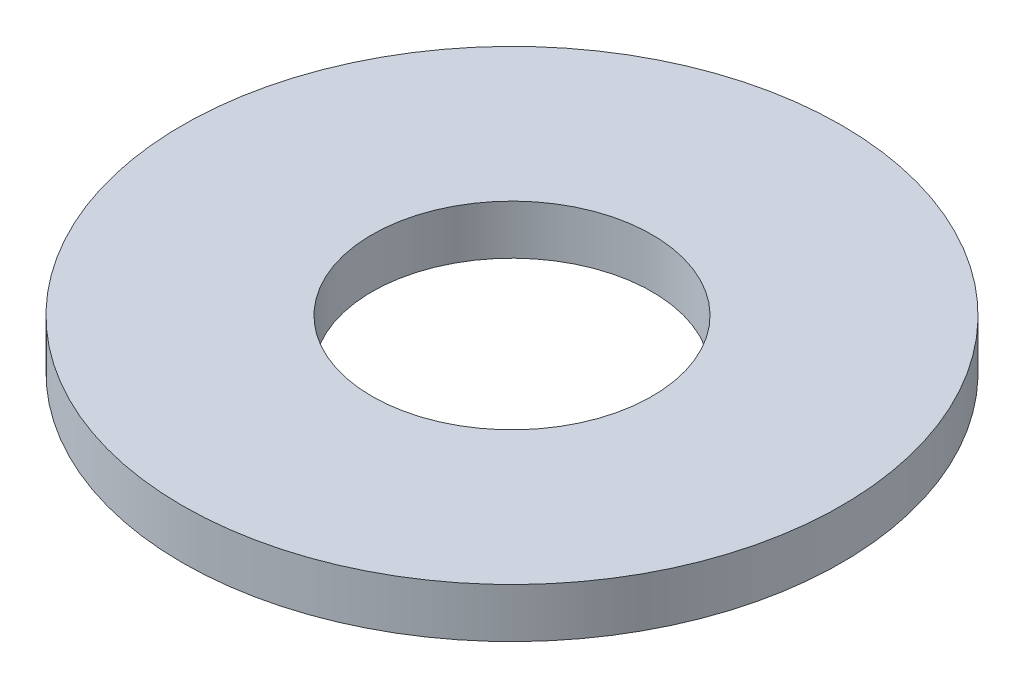
ISO-10303-21;
HEADER;
FILE_DESCRIPTION(('STEP AP214'),'2;1');
FILE_NAME('part.step','',(''),(''),'','','');
FILE_SCHEMA(('AUTOMOTIVE_DESIGN { 1 0 10303 214 1 1 1 1 }'));
ENDSEC;
DATA;
#1=APPLICATION_CONTEXT('core data for automotive mechanical design processes');
#2=APPLICATION_PROTOCOL_DEFINITION('international standard','automotive_design',2000,#1);
#3=PRODUCT_CONTEXT('',#1,'mechanical');
#4=PRODUCT('Part','Part','',(#3));
#5=PRODUCT_RELATED_PRODUCT_CATEGORY('part','',(#4));
#6=PRODUCT_DEFINITION_FORMATION('','',#4);
#7=PRODUCT_DEFINITION_CONTEXT('part definition',#1,'design');
#8=PRODUCT_DEFINITION('design','',#6,#7);
#9=PRODUCT_DEFINITION_SHAPE('','',#8);
#10=(LENGTH_UNIT() NAMED_UNIT(*) SI_UNIT(.MILLI.,.METRE.));
#11=(NAMED_UNIT(*) PLANE_ANGLE_UNIT() SI_UNIT($,.RADIAN.));
#12=(NAMED_UNIT(*) SI_UNIT($,.STERADIAN.) SOLID_ANGLE_UNIT());
#13=UNCERTAINTY_MEASURE_WITH_UNIT(LENGTH_MEASURE(1.E-05),#10,'distance_accuracy_value','');
#14=(GEOMETRIC_REPRESENTATION_CONTEXT(3) GLOBAL_UNCERTAINTY_ASSIGNED_CONTEXT((#13)) GLOBAL_UNIT_ASSIGNED_CONTEXT((#10,
#11,#12)) REPRESENTATION_CONTEXT('',''));
#15=CARTESIAN_POINT('',(0.,0.,0.));
#16=DIRECTION('',(0.,0.,1.));
#17=DIRECTION('',(1.,0.,0.));
#18=AXIS2_PLACEMENT_3D('',#15,#16,#17);
#19=CARTESIAN_POINT('',(0.,6.00000000000001,0.));
#20=DIRECTION('',(0.,1.,0.));
#21=DIRECTION('',(0.,0.,1.));
#22=AXIS2_PLACEMENT_3D('',#19,#20,#21);
#23=PLANE('',#22);
#24=CARTESIAN_POINT('',(0.,6.00000000000001,0.));
#25=DIRECTION('',(0.,1.,0.));
#26=DIRECTION('',(0.,0.,1.));
#27=AXIS2_PLACEMENT_3D('',#24,#25,#26);
#28=CIRCLE('',#27,40.);
#29=CARTESIAN_POINT('',(0.,6.00000000000001,40.0000000000001));
#30=VERTEX_POINT('',#29);
#31=EDGE_CURVE('E10',#30,#30,#28,.T.);
#32=ORIENTED_EDGE('',*,*,#31,.T.);
#33=EDGE_LOOP('',(#32));
#34=FACE_BOUND('',#33,.T.);
#35=CARTESIAN_POINT('',(0.,6.00000000000001,0.));
#36=DIRECTION('',(0.,1.,0.));
#37=DIRECTION('',(0.,0.,1.));
#38=AXIS2_PLACEMENT_3D('',#35,#36,#37);
#39=CIRCLE('',#38,17.);
#40=CARTESIAN_POINT('',(0.,6.00000000000001,17.));
#41=VERTEX_POINT('',#40);
#42=EDGE_CURVE('E43',#41,#41,#39,.T.);
#43=ORIENTED_EDGE('',*,*,#42,.F.);
#44=EDGE_LOOP('',(#43));
#45=FACE_BOUND('',#44,.T.);
#46=ADVANCED_FACE('F32',(#34,#45),#23,.T.);
#47=CARTESIAN_POINT('',(0.,0.,0.));
#48=DIRECTION('',(0.,1.,0.));
#49=DIRECTION('',(0.,0.,1.));
#50=AXIS2_PLACEMENT_3D('',#47,#48,#49);
#51=PLANE('',#50);
#52=CARTESIAN_POINT('',(0.,0.,0.));
#53=DIRECTION('',(0.,1.,0.));
#54=DIRECTION('',(0.,0.,1.));
#55=AXIS2_PLACEMENT_3D('',#52,#53,#54);
#56=CIRCLE('',#55,40.);
#57=CARTESIAN_POINT('',(0.,0.,40.0000000000001));
#58=VERTEX_POINT('',#57);
#59=EDGE_CURVE('E36',#58,#58,#56,.T.);
#60=ORIENTED_EDGE('',*,*,#59,.F.);
#61=EDGE_LOOP('',(#60));
#62=FACE_BOUND('',#61,.T.);
#63=CARTESIAN_POINT('',(0.,0.,0.));
#64=DIRECTION('',(0.,1.,0.));
#65=DIRECTION('',(0.,0.,1.));
#66=AXIS2_PLACEMENT_3D('',#63,#64,#65);
#67=CIRCLE('',#66,17.);
#68=CARTESIAN_POINT('',(0.,0.,17.));
#69=VERTEX_POINT('',#68);
#70=EDGE_CURVE('E45',#69,#69,#67,.T.);
#71=ORIENTED_EDGE('',*,*,#70,.T.);
#72=EDGE_LOOP('',(#71));
#73=FACE_BOUND('',#72,.T.);
#74=ADVANCED_FACE('F55',(#62,#73),#51,.F.);
#75=CARTESIAN_POINT('',(0.,6.00000000000001,0.));
#76=DIRECTION('',(0.,-1.,0.));
#77=DIRECTION('',(0.,0.,-1.));
#78=AXIS2_PLACEMENT_3D('',#75,#76,#77);
#79=CYLINDRICAL_SURFACE('',#78,40.);
#80=ORIENTED_EDGE('',*,*,#31,.F.);
#81=EDGE_LOOP('',(#80));
#82=FACE_BOUND('',#81,.T.);
#83=ORIENTED_EDGE('',*,*,#59,.T.);
#84=EDGE_LOOP('',(#83));
#85=FACE_BOUND('',#84,.T.);
#86=ADVANCED_FACE('F34',(#82,#85),#79,.T.);
#87=CARTESIAN_POINT('',(0.,6.00000000000001,0.));
#88=DIRECTION('',(0.,-1.,0.));
#89=DIRECTION('',(0.,0.,-1.));
#90=AXIS2_PLACEMENT_3D('',#87,#88,#89);
#91=CYLINDRICAL_SURFACE('',#90,17.);
#92=ORIENTED_EDGE('',*,*,#42,.T.);
#93=EDGE_LOOP('',(#92));
#94=FACE_BOUND('',#93,.T.);
#95=ORIENTED_EDGE('',*,*,#70,.F.);
#96=EDGE_LOOP('',(#95));
#97=FACE_BOUND('',#96,.T.);
#98=ADVANCED_FACE('F51',(#94,#97),#91,.F.);
#99=CLOSED_SHELL('',(#46,#74,#86,#98));
#100=MANIFOLD_SOLID_BREP('B2',#99);
#101=ADVANCED_BREP_SHAPE_REPRESENTATION('',(#18,#100),#14);
#102=SHAPE_DEFINITION_REPRESENTATION(#9,#101);
ENDSEC;
END-ISO-10303-21;
